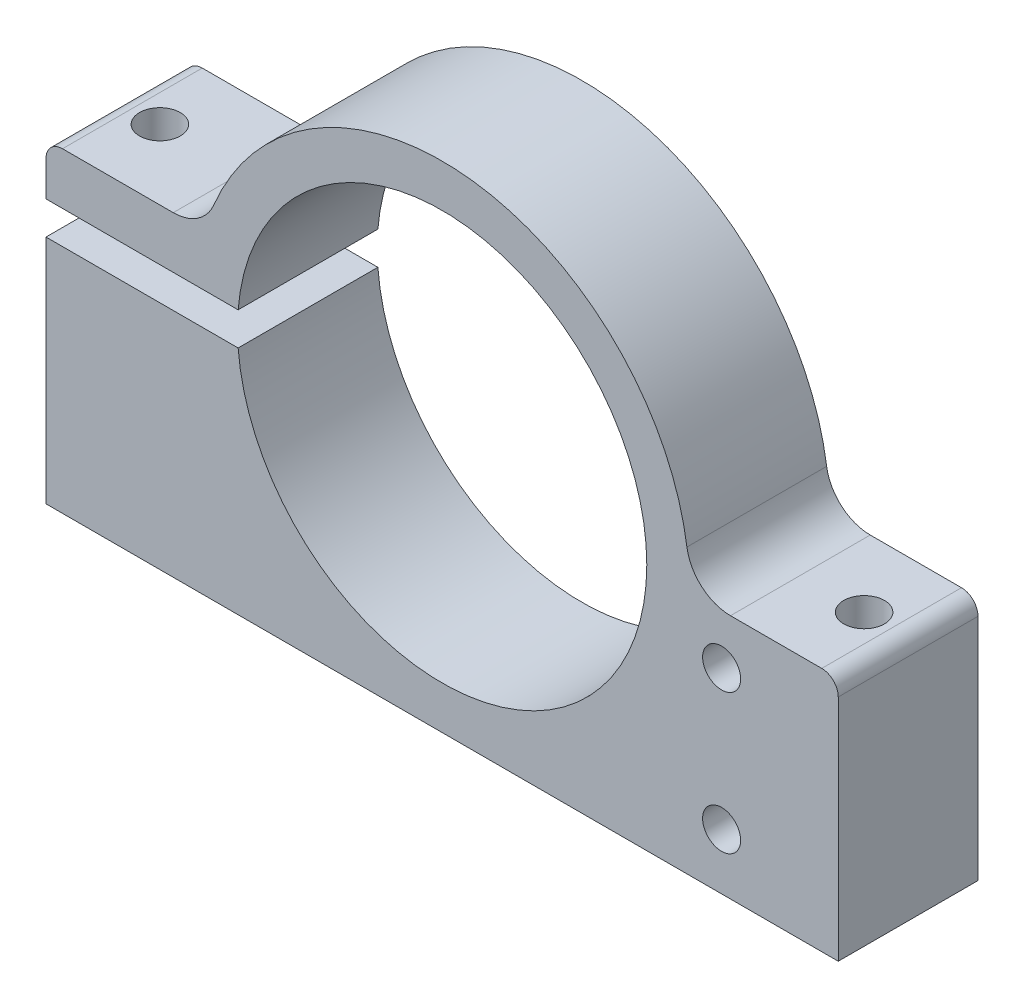
ISO-10303-21;
HEADER;
FILE_DESCRIPTION(('STEP AP214'),'2;1');
FILE_NAME('part.step','',(''),(''),'','','');
FILE_SCHEMA(('AUTOMOTIVE_DESIGN { 1 0 10303 214 1 1 1 1 }'));
ENDSEC;
DATA;
#1=APPLICATION_CONTEXT('core data for automotive mechanical design processes');
#2=APPLICATION_PROTOCOL_DEFINITION('international standard','automotive_design',2000,#1);
#3=PRODUCT_CONTEXT('',#1,'mechanical');
#4=PRODUCT('Part','Part','',(#3));
#5=PRODUCT_RELATED_PRODUCT_CATEGORY('part','',(#4));
#6=PRODUCT_DEFINITION_FORMATION('','',#4);
#7=PRODUCT_DEFINITION_CONTEXT('part definition',#1,'design');
#8=PRODUCT_DEFINITION('design','',#6,#7);
#9=PRODUCT_DEFINITION_SHAPE('','',#8);
#10=(LENGTH_UNIT() NAMED_UNIT(*) SI_UNIT(.MILLI.,.METRE.));
#11=(NAMED_UNIT(*) PLANE_ANGLE_UNIT() SI_UNIT($,.RADIAN.));
#12=(NAMED_UNIT(*) SI_UNIT($,.STERADIAN.) SOLID_ANGLE_UNIT());
#13=UNCERTAINTY_MEASURE_WITH_UNIT(LENGTH_MEASURE(1.E-05),#10,'distance_accuracy_value','');
#14=(GEOMETRIC_REPRESENTATION_CONTEXT(3) GLOBAL_UNCERTAINTY_ASSIGNED_CONTEXT((#13)) GLOBAL_UNIT_ASSIGNED_CONTEXT((#10,
#11,#12)) REPRESENTATION_CONTEXT('',''));
#15=CARTESIAN_POINT('',(0.,0.,0.));
#16=DIRECTION('',(0.,0.,1.));
#17=DIRECTION('',(1.,0.,0.));
#18=AXIS2_PLACEMENT_3D('',#15,#16,#17);
#19=CARTESIAN_POINT('',(32.,-22.5,0.));
#20=DIRECTION('',(0.,1.,0.));
#21=DIRECTION('',(-1.,0.,0.));
#22=AXIS2_PLACEMENT_3D('',#19,#20,#21);
#23=CYLINDRICAL_SURFACE('',#22,1.85);
#24=CARTESIAN_POINT('',(32.,-0.200000000000009,0.));
#25=DIRECTION('',(0.,1.,0.));
#26=DIRECTION('',(-1.,0.,0.));
#27=AXIS2_PLACEMENT_3D('',#24,#25,#26);
#28=CIRCLE('',#27,1.85);
#29=CARTESIAN_POINT('',(30.15,-0.200000000000009,0.));
#30=VERTEX_POINT('',#29);
#31=EDGE_CURVE('E221',#30,#30,#28,.F.);
#32=ORIENTED_EDGE('',*,*,#31,.F.);
#33=EDGE_LOOP('',(#32));
#34=FACE_BOUND('',#33,.T.);
#35=CARTESIAN_POINT('',(32.,-22.5,0.));
#36=DIRECTION('',(0.,1.,0.));
#37=DIRECTION('',(-1.,0.,0.));
#38=AXIS2_PLACEMENT_3D('',#35,#36,#37);
#39=CIRCLE('',#38,1.85);
#40=CARTESIAN_POINT('',(30.15,-22.5,0.));
#41=VERTEX_POINT('',#40);
#42=EDGE_CURVE('E35',#41,#41,#39,.T.);
#43=ORIENTED_EDGE('',*,*,#42,.F.);
#44=EDGE_LOOP('',(#43));
#45=FACE_BOUND('',#44,.T.);
#46=ADVANCED_FACE('F32',(#34,#45),#23,.F.);
#47=CARTESIAN_POINT('',(-32.,-22.5,0.));
#48=DIRECTION('',(0.,1.,0.));
#49=DIRECTION('',(-1.,0.,0.));
#50=AXIS2_PLACEMENT_3D('',#47,#48,#49);
#51=CYLINDRICAL_SURFACE('',#50,1.85);
#52=CARTESIAN_POINT('',(-32.,1.49999999999999,0.));
#53=DIRECTION('',(0.,1.,0.));
#54=DIRECTION('',(-1.,0.,0.));
#55=AXIS2_PLACEMENT_3D('',#52,#53,#54);
#56=CIRCLE('',#55,1.85);
#57=CARTESIAN_POINT('',(-33.85,1.49999999999999,0.));
#58=VERTEX_POINT('',#57);
#59=EDGE_CURVE('E204',#58,#58,#56,.F.);
#60=ORIENTED_EDGE('',*,*,#59,.T.);
#61=EDGE_LOOP('',(#60));
#62=FACE_BOUND('',#61,.T.);
#63=CARTESIAN_POINT('',(-32.,6.2,0.));
#64=DIRECTION('',(0.,1.,0.));
#65=DIRECTION('',(-1.,0.,0.));
#66=AXIS2_PLACEMENT_3D('',#63,#64,#65);
#67=CIRCLE('',#66,1.85);
#68=CARTESIAN_POINT('',(-33.85,6.2,0.));
#69=VERTEX_POINT('',#68);
#70=EDGE_CURVE('E210',#69,#69,#67,.T.);
#71=ORIENTED_EDGE('',*,*,#70,.T.);
#72=EDGE_LOOP('',(#71));
#73=FACE_BOUND('',#72,.T.);
#74=ADVANCED_FACE('F293',(#62,#73),#51,.F.);
#75=CARTESIAN_POINT('',(-32.,-22.5,0.));
#76=DIRECTION('',(0.,1.,0.));
#77=DIRECTION('',(-1.,0.,0.));
#78=AXIS2_PLACEMENT_3D('',#75,#76,#77);
#79=CYLINDRICAL_SURFACE('',#78,1.85);
#80=CARTESIAN_POINT('',(-32.,-22.5,0.));
#81=DIRECTION('',(0.,1.,0.));
#82=DIRECTION('',(-1.,0.,0.));
#83=AXIS2_PLACEMENT_3D('',#80,#81,#82);
#84=CIRCLE('',#83,1.85);
#85=CARTESIAN_POINT('',(-33.85,-22.5,0.));
#86=VERTEX_POINT('',#85);
#87=EDGE_CURVE('E228',#86,#86,#84,.T.);
#88=ORIENTED_EDGE('',*,*,#87,.F.);
#89=EDGE_LOOP('',(#88));
#90=FACE_BOUND('',#89,.T.);
#91=CARTESIAN_POINT('',(-32.,-1.5,0.));
#92=DIRECTION('',(0.,1.,0.));
#93=DIRECTION('',(-1.,0.,0.));
#94=AXIS2_PLACEMENT_3D('',#91,#92,#93);
#95=CIRCLE('',#94,1.85);
#96=CARTESIAN_POINT('',(-33.85,-1.5,0.));
#97=VERTEX_POINT('',#96);
#98=EDGE_CURVE('E168',#97,#97,#95,.F.);
#99=ORIENTED_EDGE('',*,*,#98,.F.);
#100=EDGE_LOOP('',(#99));
#101=FACE_BOUND('',#100,.T.);
#102=ADVANCED_FACE('F299',(#90,#101),#79,.F.);
#103=CARTESIAN_POINT('',(-36.,-1.5,-6.35));
#104=DIRECTION('',(-1.,0.,0.));
#105=DIRECTION('',(0.,-1.,0.));
#106=AXIS2_PLACEMENT_3D('',#103,#104,#105);
#107=PLANE('',#106);
#108=DIRECTION('',(0.,1.,0.));
#109=VECTOR('',#108,1.);
#110=CARTESIAN_POINT('',(-36.,0.,-6.35));
#111=LINE('',#110,#109);
#112=CARTESIAN_POINT('',(-36.,-1.5,-6.35));
#113=VERTEX_POINT('',#112);
#114=CARTESIAN_POINT('',(-36.,-22.5,-6.35));
#115=VERTEX_POINT('',#114);
#116=EDGE_CURVE('E150',#113,#115,#111,.F.);
#117=ORIENTED_EDGE('',*,*,#116,.T.);
#118=DIRECTION('',(0.,0.,-1.));
#119=VECTOR('',#118,1.);
#120=CARTESIAN_POINT('',(-36.,-22.5,-6.35));
#121=LINE('',#120,#119);
#122=CARTESIAN_POINT('',(-36.,-22.5,6.35));
#123=VERTEX_POINT('',#122);
#124=EDGE_CURVE('E141',#123,#115,#121,.T.);
#125=ORIENTED_EDGE('',*,*,#124,.F.);
#126=DIRECTION('',(0.,1.,0.));
#127=VECTOR('',#126,1.);
#128=CARTESIAN_POINT('',(-36.,0.,6.35));
#129=LINE('',#128,#127);
#130=CARTESIAN_POINT('',(-36.,-1.5,6.35));
#131=VERTEX_POINT('',#130);
#132=EDGE_CURVE('E151',#131,#123,#129,.F.);
#133=ORIENTED_EDGE('',*,*,#132,.F.);
#134=DIRECTION('',(0.,0.,1.));
#135=VECTOR('',#134,1.);
#136=CARTESIAN_POINT('',(-36.,-1.5,-6.35));
#137=LINE('',#136,#135);
#138=EDGE_CURVE('E148',#113,#131,#137,.T.);
#139=ORIENTED_EDGE('',*,*,#138,.F.);
#140=EDGE_LOOP('',(#117,#125,#133,#139));
#141=FACE_BOUND('',#140,.T.);
#142=ADVANCED_FACE('F149',(#141),#107,.T.);
#143=CARTESIAN_POINT('',(-36.,-22.5,-6.35));
#144=DIRECTION('',(0.,-1.,0.));
#145=DIRECTION('',(0.,0.,-1.));
#146=AXIS2_PLACEMENT_3D('',#143,#144,#145);
#147=PLANE('',#146);
#148=ORIENTED_EDGE('',*,*,#87,.T.);
#149=EDGE_LOOP('',(#148));
#150=FACE_BOUND('',#149,.T.);
#151=ORIENTED_EDGE('',*,*,#42,.T.);
#152=EDGE_LOOP('',(#151));
#153=FACE_BOUND('',#152,.T.);
#154=DIRECTION('',(1.,0.,0.));
#155=VECTOR('',#154,1.);
#156=CARTESIAN_POINT('',(0.,-22.5,-6.35));
#157=LINE('',#156,#155);
#158=CARTESIAN_POINT('',(36.,-22.5,-6.35));
#159=VERTEX_POINT('',#158);
#160=EDGE_CURVE('E160',#115,#159,#157,.T.);
#161=ORIENTED_EDGE('',*,*,#160,.T.);
#162=DIRECTION('',(0.,0.,1.));
#163=VECTOR('',#162,1.);
#164=CARTESIAN_POINT('',(36.,-22.5,-6.35));
#165=LINE('',#164,#163);
#166=CARTESIAN_POINT('',(36.,-22.5,6.35));
#167=VERTEX_POINT('',#166);
#168=EDGE_CURVE('E226',#167,#159,#165,.F.);
#169=ORIENTED_EDGE('',*,*,#168,.F.);
#170=DIRECTION('',(1.,0.,0.));
#171=VECTOR('',#170,1.);
#172=CARTESIAN_POINT('',(0.,-22.5,6.35));
#173=LINE('',#172,#171);
#174=EDGE_CURVE('E193',#123,#167,#173,.T.);
#175=ORIENTED_EDGE('',*,*,#174,.F.);
#176=ORIENTED_EDGE('',*,*,#124,.T.);
#177=EDGE_LOOP('',(#161,#169,#175,#176));
#178=FACE_BOUND('',#177,.T.);
#179=ADVANCED_FACE('F290',(#150,#153,#178),#147,.T.);
#180=CARTESIAN_POINT('',(36.,-22.5,-6.35));
#181=DIRECTION('',(1.,0.,0.));
#182=DIRECTION('',(0.,1.,0.));
#183=AXIS2_PLACEMENT_3D('',#180,#181,#182);
#184=PLANE('',#183);
#185=DIRECTION('',(0.,1.,0.));
#186=VECTOR('',#185,1.);
#187=CARTESIAN_POINT('',(36.,0.,6.35));
#188=LINE('',#187,#186);
#189=CARTESIAN_POINT('',(36.,-1.70000000000001,6.35));
#190=VERTEX_POINT('',#189);
#191=EDGE_CURVE('E191',#167,#190,#188,.T.);
#192=ORIENTED_EDGE('',*,*,#191,.F.);
#193=ORIENTED_EDGE('',*,*,#168,.T.);
#194=DIRECTION('',(0.,1.,0.));
#195=VECTOR('',#194,1.);
#196=CARTESIAN_POINT('',(36.,0.,-6.35));
#197=LINE('',#196,#195);
#198=CARTESIAN_POINT('',(36.,-1.70000000000001,-6.35));
#199=VERTEX_POINT('',#198);
#200=EDGE_CURVE('E232',#159,#199,#197,.T.);
#201=ORIENTED_EDGE('',*,*,#200,.T.);
#202=DIRECTION('',(0.,0.,1.));
#203=VECTOR('',#202,1.);
#204=CARTESIAN_POINT('',(36.,-1.70000000000001,-6.35));
#205=LINE('',#204,#203);
#206=EDGE_CURVE('E224',#190,#199,#205,.F.);
#207=ORIENTED_EDGE('',*,*,#206,.F.);
#208=EDGE_LOOP('',(#192,#193,#201,#207));
#209=FACE_BOUND('',#208,.T.);
#210=ADVANCED_FACE('F359',(#209),#184,.T.);
#211=CARTESIAN_POINT('',(34.5,-1.70000000000001,-6.35));
#212=DIRECTION('',(0.,0.,1.));
#213=DIRECTION('',(1.,0.,0.));
#214=AXIS2_PLACEMENT_3D('',#211,#212,#213);
#215=CYLINDRICAL_SURFACE('',#214,1.5);
#216=CARTESIAN_POINT('',(34.5,-1.70000000000001,6.35));
#217=DIRECTION('',(0.,0.,1.));
#218=DIRECTION('',(1.,0.,0.));
#219=AXIS2_PLACEMENT_3D('',#216,#217,#218);
#220=CIRCLE('',#219,1.5);
#221=CARTESIAN_POINT('',(34.5,-0.200000000000006,6.35));
#222=VERTEX_POINT('',#221);
#223=EDGE_CURVE('E190',#190,#222,#220,.T.);
#224=ORIENTED_EDGE('',*,*,#223,.F.);
#225=ORIENTED_EDGE('',*,*,#206,.T.);
#226=CARTESIAN_POINT('',(34.5,-1.70000000000001,-6.35));
#227=DIRECTION('',(0.,0.,1.));
#228=DIRECTION('',(1.,0.,0.));
#229=AXIS2_PLACEMENT_3D('',#226,#227,#228);
#230=CIRCLE('',#229,1.5);
#231=CARTESIAN_POINT('',(34.5,-0.200000000000006,-6.35));
#232=VERTEX_POINT('',#231);
#233=EDGE_CURVE('E268',#199,#232,#230,.T.);
#234=ORIENTED_EDGE('',*,*,#233,.T.);
#235=DIRECTION('',(0.,0.,1.));
#236=VECTOR('',#235,1.);
#237=CARTESIAN_POINT('',(34.5,-0.200000000000006,-6.35));
#238=LINE('',#237,#236);
#239=EDGE_CURVE('E222',#222,#232,#238,.F.);
#240=ORIENTED_EDGE('',*,*,#239,.F.);
#241=EDGE_LOOP('',(#224,#225,#234,#240));
#242=FACE_BOUND('',#241,.T.);
#243=ADVANCED_FACE('F355',(#242),#215,.T.);
#244=CARTESIAN_POINT('',(36.,-0.200000000000006,-6.35));
#245=DIRECTION('',(0.,1.,0.));
#246=DIRECTION('',(-1.,0.,0.));
#247=AXIS2_PLACEMENT_3D('',#244,#245,#246);
#248=PLANE('',#247);
#249=ORIENTED_EDGE('',*,*,#31,.T.);
#250=EDGE_LOOP('',(#249));
#251=FACE_BOUND('',#250,.T.);
#252=DIRECTION('',(1.,0.,0.));
#253=VECTOR('',#252,1.);
#254=CARTESIAN_POINT('',(0.,-0.200000000000006,-6.35));
#255=LINE('',#254,#253);
#256=CARTESIAN_POINT('',(26.2059229946209,-0.200000000000008,-6.35));
#257=VERTEX_POINT('',#256);
#258=EDGE_CURVE('E267',#232,#257,#255,.F.);
#259=ORIENTED_EDGE('',*,*,#258,.T.);
#260=DIRECTION('',(0.,0.,1.));
#261=VECTOR('',#260,1.);
#262=CARTESIAN_POINT('',(26.2059229946209,-0.20000000000001,-6.35));
#263=LINE('',#262,#261);
#264=CARTESIAN_POINT('',(26.2059229946209,-0.200000000000008,6.35));
#265=VERTEX_POINT('',#264);
#266=EDGE_CURVE('E218',#257,#265,#263,.T.);
#267=ORIENTED_EDGE('',*,*,#266,.T.);
#268=DIRECTION('',(1.,0.,0.));
#269=VECTOR('',#268,1.);
#270=CARTESIAN_POINT('',(0.,-0.200000000000006,6.35));
#271=LINE('',#270,#269);
#272=EDGE_CURVE('E187',#222,#265,#271,.F.);
#273=ORIENTED_EDGE('',*,*,#272,.F.);
#274=ORIENTED_EDGE('',*,*,#239,.T.);
#275=EDGE_LOOP('',(#259,#267,#273,#274));
#276=FACE_BOUND('',#275,.T.);
#277=ADVANCED_FACE('F351',(#251,#276),#248,.T.);
#278=CARTESIAN_POINT('',(26.2059229946209,3.79999999999999,-6.35));
#279=DIRECTION('',(0.,0.,1.));
#280=DIRECTION('',(1.,0.,0.));
#281=AXIS2_PLACEMENT_3D('',#278,#279,#280);
#282=CYLINDRICAL_SURFACE('',#281,4.);
#283=DIRECTION('',(0.,0.,1.));
#284=VECTOR('',#283,1.);
#285=CARTESIAN_POINT('',(22.2473243549501,3.22598187311177,-6.35));
#286=LINE('',#285,#284);
#287=CARTESIAN_POINT('',(22.2473243549501,3.22598187311177,6.35));
#288=VERTEX_POINT('',#287);
#289=CARTESIAN_POINT('',(22.2473243549501,3.22598187311177,-6.35));
#290=VERTEX_POINT('',#289);
#291=EDGE_CURVE('E216',#288,#290,#286,.F.);
#292=ORIENTED_EDGE('',*,*,#291,.F.);
#293=CARTESIAN_POINT('',(26.2059229946209,3.79999999999999,6.35));
#294=DIRECTION('',(0.,0.,1.));
#295=DIRECTION('',(1.,0.,0.));
#296=AXIS2_PLACEMENT_3D('',#293,#294,#295);
#297=CIRCLE('',#296,4.);
#298=EDGE_CURVE('E189',#265,#288,#297,.F.);
#299=ORIENTED_EDGE('',*,*,#298,.F.);
#300=ORIENTED_EDGE('',*,*,#266,.F.);
#301=CARTESIAN_POINT('',(26.2059229946209,3.79999999999999,-6.35));
#302=DIRECTION('',(0.,0.,1.));
#303=DIRECTION('',(1.,0.,0.));
#304=AXIS2_PLACEMENT_3D('',#301,#302,#303);
#305=CIRCLE('',#304,4.);
#306=EDGE_CURVE('E264',#257,#290,#305,.F.);
#307=ORIENTED_EDGE('',*,*,#306,.T.);
#308=EDGE_LOOP('',(#292,#299,#300,#307));
#309=FACE_BOUND('',#308,.T.);
#310=ADVANCED_FACE('F347',(#309),#282,.F.);
#311=CARTESIAN_POINT('',(0.,0.,-6.35));
#312=DIRECTION('',(0.,0.,1.));
#313=DIRECTION('',(1.,0.,0.));
#314=AXIS2_PLACEMENT_3D('',#311,#312,#313);
#315=CYLINDRICAL_SURFACE('',#314,22.48);
#316=CARTESIAN_POINT('',(0.,0.,6.35));
#317=DIRECTION('',(0.,0.,1.));
#318=DIRECTION('',(1.,0.,0.));
#319=AXIS2_PLACEMENT_3D('',#316,#317,#318);
#320=CIRCLE('',#319,22.48);
#321=CARTESIAN_POINT('',(-20.745322465964,8.65921450151056,6.35));
#322=VERTEX_POINT('',#321);
#323=EDGE_CURVE('E274',#288,#322,#320,.T.);
#324=ORIENTED_EDGE('',*,*,#323,.F.);
#325=ORIENTED_EDGE('',*,*,#291,.T.);
#326=CARTESIAN_POINT('',(0.,0.,-6.35));
#327=DIRECTION('',(0.,0.,1.));
#328=DIRECTION('',(1.,0.,0.));
#329=AXIS2_PLACEMENT_3D('',#326,#327,#328);
#330=CIRCLE('',#329,22.48);
#331=CARTESIAN_POINT('',(-20.745322465964,8.65921450151056,-6.35));
#332=VERTEX_POINT('',#331);
#333=EDGE_CURVE('E261',#290,#332,#330,.T.);
#334=ORIENTED_EDGE('',*,*,#333,.T.);
#335=DIRECTION('',(0.,0.,1.));
#336=VECTOR('',#335,1.);
#337=CARTESIAN_POINT('',(-20.745322465964,8.65921450151056,-6.35));
#338=LINE('',#337,#336);
#339=EDGE_CURVE('E213',#332,#322,#338,.T.);
#340=ORIENTED_EDGE('',*,*,#339,.T.);
#341=EDGE_LOOP('',(#324,#325,#334,#340));
#342=FACE_BOUND('',#341,.T.);
#343=ADVANCED_FACE('F343',(#342),#315,.T.);
#344=CARTESIAN_POINT('',(-24.4366609830394,10.2,-6.35));
#345=DIRECTION('',(0.,0.,1.));
#346=DIRECTION('',(1.,0.,0.));
#347=AXIS2_PLACEMENT_3D('',#344,#345,#346);
#348=CYLINDRICAL_SURFACE('',#347,4.);
#349=DIRECTION('',(0.,0.,-1.));
#350=VECTOR('',#349,1.);
#351=CARTESIAN_POINT('',(-24.4366609830394,6.19999999999999,-6.35));
#352=LINE('',#351,#350);
#353=CARTESIAN_POINT('',(-24.4366609830394,6.19999999999999,-6.35));
#354=VERTEX_POINT('',#353);
#355=CARTESIAN_POINT('',(-24.4366609830394,6.19999999999999,6.35));
#356=VERTEX_POINT('',#355);
#357=EDGE_CURVE('E211',#354,#356,#352,.F.);
#358=ORIENTED_EDGE('',*,*,#357,.T.);
#359=CARTESIAN_POINT('',(-24.4366609830394,10.2,6.35));
#360=DIRECTION('',(0.,0.,1.));
#361=DIRECTION('',(1.,0.,0.));
#362=AXIS2_PLACEMENT_3D('',#359,#360,#361);
#363=CIRCLE('',#362,4.);
#364=EDGE_CURVE('E155',#322,#356,#363,.F.);
#365=ORIENTED_EDGE('',*,*,#364,.F.);
#366=ORIENTED_EDGE('',*,*,#339,.F.);
#367=CARTESIAN_POINT('',(-24.4366609830394,10.2,-6.35));
#368=DIRECTION('',(0.,0.,1.));
#369=DIRECTION('',(1.,0.,0.));
#370=AXIS2_PLACEMENT_3D('',#367,#368,#369);
#371=CIRCLE('',#370,4.);
#372=EDGE_CURVE('E258',#332,#354,#371,.F.);
#373=ORIENTED_EDGE('',*,*,#372,.T.);
#374=EDGE_LOOP('',(#358,#365,#366,#373));
#375=FACE_BOUND('',#374,.T.);
#376=ADVANCED_FACE('F339',(#375),#348,.F.);
#377=CARTESIAN_POINT('',(-36.,6.19999999999999,-6.35));
#378=DIRECTION('',(0.,-1.,0.));
#379=DIRECTION('',(0.,0.,-1.));
#380=AXIS2_PLACEMENT_3D('',#377,#378,#379);
#381=PLANE('',#380);
#382=ORIENTED_EDGE('',*,*,#70,.F.);
#383=EDGE_LOOP('',(#382));
#384=FACE_BOUND('',#383,.T.);
#385=DIRECTION('',(0.,0.,1.));
#386=VECTOR('',#385,1.);
#387=CARTESIAN_POINT('',(-34.5,6.19999999999999,-6.35));
#388=LINE('',#387,#386);
#389=CARTESIAN_POINT('',(-34.5,6.19999999999999,6.35));
#390=VERTEX_POINT('',#389);
#391=CARTESIAN_POINT('',(-34.5,6.19999999999999,-6.35));
#392=VERTEX_POINT('',#391);
#393=EDGE_CURVE('E208',#390,#392,#388,.F.);
#394=ORIENTED_EDGE('',*,*,#393,.F.);
#395=DIRECTION('',(1.,0.,0.));
#396=VECTOR('',#395,1.);
#397=CARTESIAN_POINT('',(0.,6.19999999999999,6.35));
#398=LINE('',#397,#396);
#399=EDGE_CURVE('E113',#356,#390,#398,.F.);
#400=ORIENTED_EDGE('',*,*,#399,.F.);
#401=ORIENTED_EDGE('',*,*,#357,.F.);
#402=DIRECTION('',(1.,0.,0.));
#403=VECTOR('',#402,1.);
#404=CARTESIAN_POINT('',(0.,6.19999999999999,-6.35));
#405=LINE('',#404,#403);
#406=EDGE_CURVE('E257',#354,#392,#405,.F.);
#407=ORIENTED_EDGE('',*,*,#406,.T.);
#408=EDGE_LOOP('',(#394,#400,#401,#407));
#409=FACE_BOUND('',#408,.T.);
#410=ADVANCED_FACE('F335',(#384,#409),#381,.F.);
#411=CARTESIAN_POINT('',(-34.5,4.69999999999999,-6.35));
#412=DIRECTION('',(0.,0.,1.));
#413=DIRECTION('',(1.,0.,0.));
#414=AXIS2_PLACEMENT_3D('',#411,#412,#413);
#415=CYLINDRICAL_SURFACE('',#414,1.5);
#416=CARTESIAN_POINT('',(-34.5,4.69999999999999,6.35));
#417=DIRECTION('',(0.,0.,1.));
#418=DIRECTION('',(1.,0.,0.));
#419=AXIS2_PLACEMENT_3D('',#416,#417,#418);
#420=CIRCLE('',#419,1.5);
#421=CARTESIAN_POINT('',(-36.,4.69999999999999,6.35));
#422=VERTEX_POINT('',#421);
#423=EDGE_CURVE('E118',#390,#422,#420,.T.);
#424=ORIENTED_EDGE('',*,*,#423,.F.);
#425=ORIENTED_EDGE('',*,*,#393,.T.);
#426=CARTESIAN_POINT('',(-34.5,4.69999999999999,-6.35));
#427=DIRECTION('',(0.,0.,1.));
#428=DIRECTION('',(1.,0.,0.));
#429=AXIS2_PLACEMENT_3D('',#426,#427,#428);
#430=CIRCLE('',#429,1.5);
#431=CARTESIAN_POINT('',(-36.,4.69999999999999,-6.35));
#432=VERTEX_POINT('',#431);
#433=EDGE_CURVE('E254',#392,#432,#430,.T.);
#434=ORIENTED_EDGE('',*,*,#433,.T.);
#435=DIRECTION('',(0.,0.,-1.));
#436=VECTOR('',#435,1.);
#437=CARTESIAN_POINT('',(-36.,4.69999999999999,-6.35));
#438=LINE('',#437,#436);
#439=EDGE_CURVE('E205',#432,#422,#438,.F.);
#440=ORIENTED_EDGE('',*,*,#439,.T.);
#441=EDGE_LOOP('',(#424,#425,#434,#440));
#442=FACE_BOUND('',#441,.T.);
#443=ADVANCED_FACE('F331',(#442),#415,.T.);
#444=CARTESIAN_POINT('',(-36.,1.5,-6.35));
#445=DIRECTION('',(1.,0.,0.));
#446=DIRECTION('',(0.,0.,-1.));
#447=AXIS2_PLACEMENT_3D('',#444,#445,#446);
#448=PLANE('',#447);
#449=ORIENTED_EDGE('',*,*,#439,.F.);
#450=DIRECTION('',(0.,1.,0.));
#451=VECTOR('',#450,1.);
#452=CARTESIAN_POINT('',(-36.,0.,-6.35));
#453=LINE('',#452,#451);
#454=CARTESIAN_POINT('',(-36.,1.5,-6.35));
#455=VERTEX_POINT('',#454);
#456=EDGE_CURVE('E183',#432,#455,#453,.F.);
#457=ORIENTED_EDGE('',*,*,#456,.T.);
#458=DIRECTION('',(0.,0.,1.));
#459=VECTOR('',#458,1.);
#460=CARTESIAN_POINT('',(-36.,1.49999999999999,-6.35));
#461=LINE('',#460,#459);
#462=CARTESIAN_POINT('',(-36.,1.5,6.35));
#463=VERTEX_POINT('',#462);
#464=EDGE_CURVE('E207',#455,#463,#461,.T.);
#465=ORIENTED_EDGE('',*,*,#464,.T.);
#466=DIRECTION('',(0.,1.,0.));
#467=VECTOR('',#466,1.);
#468=CARTESIAN_POINT('',(-36.,0.,6.35));
#469=LINE('',#468,#467);
#470=EDGE_CURVE('E122',#422,#463,#469,.F.);
#471=ORIENTED_EDGE('',*,*,#470,.F.);
#472=EDGE_LOOP('',(#449,#457,#465,#471));
#473=FACE_BOUND('',#472,.T.);
#474=ADVANCED_FACE('F327',(#473),#448,.F.);
#475=CARTESIAN_POINT('',(0.,1.5,-6.35));
#476=DIRECTION('',(0.,1.,0.));
#477=DIRECTION('',(-1.,0.,0.));
#478=AXIS2_PLACEMENT_3D('',#475,#476,#477);
#479=PLANE('',#478);
#480=ORIENTED_EDGE('',*,*,#59,.F.);
#481=EDGE_LOOP('',(#480));
#482=FACE_BOUND('',#481,.T.);
#483=DIRECTION('',(0.,0.,1.));
#484=VECTOR('',#483,1.);
#485=CARTESIAN_POINT('',(-18.5394174665765,1.5,-6.35));
#486=LINE('',#485,#484);
#487=CARTESIAN_POINT('',(-18.5394174665765,1.5,-6.35));
#488=VERTEX_POINT('',#487);
#489=CARTESIAN_POINT('',(-18.5394174665765,1.5,6.35));
#490=VERTEX_POINT('',#489);
#491=EDGE_CURVE('E180',#488,#490,#486,.T.);
#492=ORIENTED_EDGE('',*,*,#491,.T.);
#493=DIRECTION('',(1.,0.,0.));
#494=VECTOR('',#493,1.);
#495=CARTESIAN_POINT('',(0.,1.5,6.35));
#496=LINE('',#495,#494);
#497=EDGE_CURVE('E196',#463,#490,#496,.T.);
#498=ORIENTED_EDGE('',*,*,#497,.F.);
#499=ORIENTED_EDGE('',*,*,#464,.F.);
#500=DIRECTION('',(1.,0.,0.));
#501=VECTOR('',#500,1.);
#502=CARTESIAN_POINT('',(0.,1.5,-6.35));
#503=LINE('',#502,#501);
#504=EDGE_CURVE('E165',#455,#488,#503,.T.);
#505=ORIENTED_EDGE('',*,*,#504,.T.);
#506=EDGE_LOOP('',(#492,#498,#499,#505));
#507=FACE_BOUND('',#506,.T.);
#508=ADVANCED_FACE('F323',(#482,#507),#479,.F.);
#509=CARTESIAN_POINT('',(0.,0.,6.35));
#510=DIRECTION('',(0.,0.,1.));
#511=DIRECTION('',(1.,0.,0.));
#512=AXIS2_PLACEMENT_3D('',#509,#510,#511);
#513=PLANE('',#512);
#514=CARTESIAN_POINT('',(25.4,-4.71999999999999,6.35));
#515=DIRECTION('',(0.,0.,1.));
#516=DIRECTION('',(1.,0.,0.));
#517=AXIS2_PLACEMENT_3D('',#514,#515,#516);
#518=CIRCLE('',#517,1.72719999999999);
#519=CARTESIAN_POINT('',(27.1272,-4.71999999999999,6.35));
#520=VERTEX_POINT('',#519);
#521=EDGE_CURVE('E471',#520,#520,#518,.T.);
#522=ORIENTED_EDGE('',*,*,#521,.F.);
#523=EDGE_LOOP('',(#522));
#524=FACE_BOUND('',#523,.T.);
#525=CARTESIAN_POINT('',(25.4,-17.42,6.35));
#526=DIRECTION('',(0.,0.,1.));
#527=DIRECTION('',(1.,0.,0.));
#528=AXIS2_PLACEMENT_3D('',#525,#526,#527);
#529=CIRCLE('',#528,1.72719999999999);
#530=CARTESIAN_POINT('',(27.1272,-17.42,6.35));
#531=VERTEX_POINT('',#530);
#532=EDGE_CURVE('E236',#531,#531,#529,.T.);
#533=ORIENTED_EDGE('',*,*,#532,.F.);
#534=EDGE_LOOP('',(#533));
#535=FACE_BOUND('',#534,.T.);
#536=ORIENTED_EDGE('',*,*,#323,.T.);
#537=ORIENTED_EDGE('',*,*,#364,.T.);
#538=ORIENTED_EDGE('',*,*,#399,.T.);
#539=ORIENTED_EDGE('',*,*,#423,.T.);
#540=ORIENTED_EDGE('',*,*,#470,.T.);
#541=ORIENTED_EDGE('',*,*,#497,.T.);
#542=CARTESIAN_POINT('',(0.,0.,6.35));
#543=DIRECTION('',(0.,0.,1.));
#544=DIRECTION('',(1.,0.,0.));
#545=AXIS2_PLACEMENT_3D('',#542,#543,#544);
#546=CIRCLE('',#545,18.6);
#547=CARTESIAN_POINT('',(-18.5394174665765,-1.5,6.35));
#548=VERTEX_POINT('',#547);
#549=EDGE_CURVE('E179',#490,#548,#546,.F.);
#550=ORIENTED_EDGE('',*,*,#549,.T.);
#551=DIRECTION('',(-1.,0.,0.));
#552=VECTOR('',#551,1.);
#553=CARTESIAN_POINT('',(0.,-1.5,6.35));
#554=LINE('',#553,#552);
#555=EDGE_CURVE('E154',#131,#548,#554,.F.);
#556=ORIENTED_EDGE('',*,*,#555,.F.);
#557=ORIENTED_EDGE('',*,*,#132,.T.);
#558=ORIENTED_EDGE('',*,*,#174,.T.);
#559=ORIENTED_EDGE('',*,*,#191,.T.);
#560=ORIENTED_EDGE('',*,*,#223,.T.);
#561=ORIENTED_EDGE('',*,*,#272,.T.);
#562=ORIENTED_EDGE('',*,*,#298,.T.);
#563=EDGE_LOOP('',(#536,#537,#538,#539,#540,#541,#550,#556,#557,#558,#559,#560,#561,#562));
#564=FACE_BOUND('',#563,.T.);
#565=ADVANCED_FACE('F319',(#524,#535,#564),#513,.T.);
#566=CARTESIAN_POINT('',(0.,-1.5,-6.35));
#567=DIRECTION('',(0.,1.,0.));
#568=DIRECTION('',(-1.,0.,0.));
#569=AXIS2_PLACEMENT_3D('',#566,#567,#568);
#570=PLANE('',#569);
#571=ORIENTED_EDGE('',*,*,#98,.T.);
#572=EDGE_LOOP('',(#571));
#573=FACE_BOUND('',#572,.T.);
#574=ORIENTED_EDGE('',*,*,#138,.T.);
#575=ORIENTED_EDGE('',*,*,#555,.T.);
#576=DIRECTION('',(0.,0.,1.));
#577=VECTOR('',#576,1.);
#578=CARTESIAN_POINT('',(-18.5394174665765,-1.49999999999999,-6.35));
#579=LINE('',#578,#577);
#580=CARTESIAN_POINT('',(-18.5394174665765,-1.5,-6.35));
#581=VERTEX_POINT('',#580);
#582=EDGE_CURVE('E41',#548,#581,#579,.F.);
#583=ORIENTED_EDGE('',*,*,#582,.T.);
#584=DIRECTION('',(1.,0.,0.));
#585=VECTOR('',#584,1.);
#586=CARTESIAN_POINT('',(0.,-1.5,-6.35));
#587=LINE('',#586,#585);
#588=EDGE_CURVE('E49',#581,#113,#587,.F.);
#589=ORIENTED_EDGE('',*,*,#588,.T.);
#590=EDGE_LOOP('',(#574,#575,#583,#589));
#591=FACE_BOUND('',#590,.T.);
#592=ADVANCED_FACE('F163',(#573,#591),#570,.T.);
#593=CARTESIAN_POINT('',(0.,0.,-6.35));
#594=DIRECTION('',(0.,0.,1.));
#595=DIRECTION('',(1.,0.,0.));
#596=AXIS2_PLACEMENT_3D('',#593,#594,#595);
#597=PLANE('',#596);
#598=CARTESIAN_POINT('',(25.4,-4.71999999999999,-6.35));
#599=DIRECTION('',(0.,0.,-1.));
#600=DIRECTION('',(-1.,0.,0.));
#601=AXIS2_PLACEMENT_3D('',#598,#599,#600);
#602=CIRCLE('',#601,1.72719999999999);
#603=CARTESIAN_POINT('',(23.6728000000001,-4.71999999999999,-6.35));
#604=VERTEX_POINT('',#603);
#605=EDGE_CURVE('E474',#604,#604,#602,.T.);
#606=ORIENTED_EDGE('',*,*,#605,.F.);
#607=EDGE_LOOP('',(#606));
#608=FACE_BOUND('',#607,.T.);
#609=CARTESIAN_POINT('',(25.4,-17.42,-6.35));
#610=DIRECTION('',(0.,0.,-1.));
#611=DIRECTION('',(-1.,0.,0.));
#612=AXIS2_PLACEMENT_3D('',#609,#610,#611);
#613=CIRCLE('',#612,1.72719999999999);
#614=CARTESIAN_POINT('',(23.6728000000001,-17.42,-6.35));
#615=VERTEX_POINT('',#614);
#616=EDGE_CURVE('E476',#615,#615,#613,.T.);
#617=ORIENTED_EDGE('',*,*,#616,.F.);
#618=EDGE_LOOP('',(#617));
#619=FACE_BOUND('',#618,.T.);
#620=ORIENTED_EDGE('',*,*,#433,.F.);
#621=ORIENTED_EDGE('',*,*,#406,.F.);
#622=ORIENTED_EDGE('',*,*,#372,.F.);
#623=ORIENTED_EDGE('',*,*,#333,.F.);
#624=ORIENTED_EDGE('',*,*,#306,.F.);
#625=ORIENTED_EDGE('',*,*,#258,.F.);
#626=ORIENTED_EDGE('',*,*,#233,.F.);
#627=ORIENTED_EDGE('',*,*,#200,.F.);
#628=ORIENTED_EDGE('',*,*,#160,.F.);
#629=ORIENTED_EDGE('',*,*,#116,.F.);
#630=ORIENTED_EDGE('',*,*,#588,.F.);
#631=CARTESIAN_POINT('',(0.,0.,-6.35));
#632=DIRECTION('',(0.,0.,1.));
#633=DIRECTION('',(1.,0.,0.));
#634=AXIS2_PLACEMENT_3D('',#631,#632,#633);
#635=CIRCLE('',#634,18.6);
#636=EDGE_CURVE('E11',#581,#488,#635,.T.);
#637=ORIENTED_EDGE('',*,*,#636,.T.);
#638=ORIENTED_EDGE('',*,*,#504,.F.);
#639=ORIENTED_EDGE('',*,*,#456,.F.);
#640=EDGE_LOOP('',(#620,#621,#622,#623,#624,#625,#626,#627,#628,#629,#630,#637,#638,#639));
#641=FACE_BOUND('',#640,.T.);
#642=ADVANCED_FACE('F158',(#608,#619,#641),#597,.F.);
#643=CARTESIAN_POINT('',(0.,0.,-6.35));
#644=DIRECTION('',(0.,0.,1.));
#645=DIRECTION('',(1.,0.,0.));
#646=AXIS2_PLACEMENT_3D('',#643,#644,#645);
#647=CYLINDRICAL_SURFACE('',#646,18.6);
#648=ORIENTED_EDGE('',*,*,#582,.F.);
#649=ORIENTED_EDGE('',*,*,#549,.F.);
#650=ORIENTED_EDGE('',*,*,#491,.F.);
#651=ORIENTED_EDGE('',*,*,#636,.F.);
#652=EDGE_LOOP('',(#648,#649,#650,#651));
#653=FACE_BOUND('',#652,.T.);
#654=ADVANCED_FACE('F304',(#653),#647,.F.);
#655=CARTESIAN_POINT('',(25.4,-17.42,-6.35));
#656=DIRECTION('',(0.,0.,-1.));
#657=DIRECTION('',(-1.,0.,0.));
#658=AXIS2_PLACEMENT_3D('',#655,#656,#657);
#659=CYLINDRICAL_SURFACE('',#658,1.72719999999999);
#660=ORIENTED_EDGE('',*,*,#532,.T.);
#661=EDGE_LOOP('',(#660));
#662=FACE_BOUND('',#661,.T.);
#663=ORIENTED_EDGE('',*,*,#616,.T.);
#664=EDGE_LOOP('',(#663));
#665=FACE_BOUND('',#664,.T.);
#666=ADVANCED_FACE('F295',(#662,#665),#659,.F.);
#667=CARTESIAN_POINT('',(25.4,-4.71999999999999,-6.35));
#668=DIRECTION('',(0.,0.,-1.));
#669=DIRECTION('',(-1.,0.,0.));
#670=AXIS2_PLACEMENT_3D('',#667,#668,#669);
#671=CYLINDRICAL_SURFACE('',#670,1.72719999999999);
#672=ORIENTED_EDGE('',*,*,#521,.T.);
#673=EDGE_LOOP('',(#672));
#674=FACE_BOUND('',#673,.T.);
#675=ORIENTED_EDGE('',*,*,#605,.T.);
#676=EDGE_LOOP('',(#675));
#677=FACE_BOUND('',#676,.T.);
#678=ADVANCED_FACE('F303',(#674,#677),#671,.F.);
#679=CLOSED_SHELL('',(#46,#74,#102,#142,#179,#210,#243,#277,#310,#343,#376,#410,#443,#474,#508,
#565,#592,#642,#654,#666,#678));
#680=MANIFOLD_SOLID_BREP('B2',#679);
#681=ADVANCED_BREP_SHAPE_REPRESENTATION('',(#18,#680),#14);
#682=SHAPE_DEFINITION_REPRESENTATION(#9,#681);
ENDSEC;
END-ISO-10303-21;
